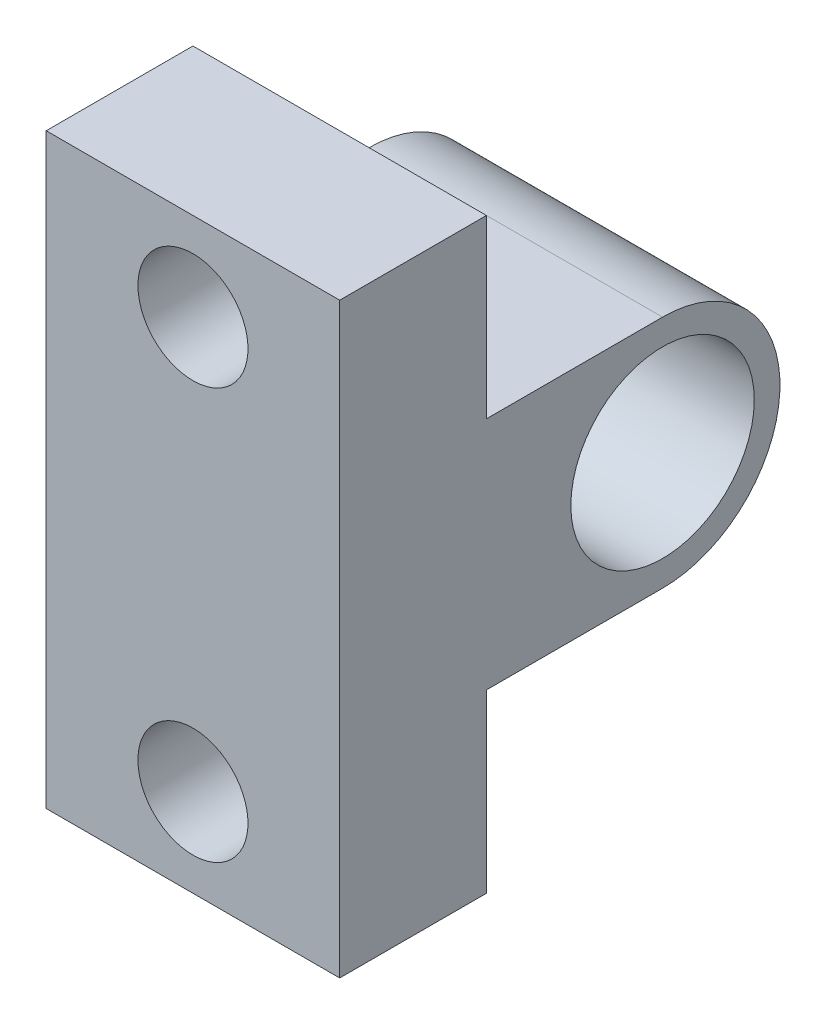
ISO-10303-21;
HEADER;
FILE_DESCRIPTION(('STEP AP214'),'2;1');
FILE_NAME('part.step','',(''),(''),'','','');
FILE_SCHEMA(('AUTOMOTIVE_DESIGN { 1 0 10303 214 1 1 1 1 }'));
ENDSEC;
DATA;
#1=APPLICATION_CONTEXT('core data for automotive mechanical design processes');
#2=APPLICATION_PROTOCOL_DEFINITION('international standard','automotive_design',2000,#1);
#3=PRODUCT_CONTEXT('',#1,'mechanical');
#4=PRODUCT('Part','Part','',(#3));
#5=PRODUCT_RELATED_PRODUCT_CATEGORY('part','',(#4));
#6=PRODUCT_DEFINITION_FORMATION('','',#4);
#7=PRODUCT_DEFINITION_CONTEXT('part definition',#1,'design');
#8=PRODUCT_DEFINITION('design','',#6,#7);
#9=PRODUCT_DEFINITION_SHAPE('','',#8);
#10=(LENGTH_UNIT() NAMED_UNIT(*) SI_UNIT(.MILLI.,.METRE.));
#11=(NAMED_UNIT(*) PLANE_ANGLE_UNIT() SI_UNIT($,.RADIAN.));
#12=(NAMED_UNIT(*) SI_UNIT($,.STERADIAN.) SOLID_ANGLE_UNIT());
#13=UNCERTAINTY_MEASURE_WITH_UNIT(LENGTH_MEASURE(1.E-05),#10,'distance_accuracy_value','');
#14=(GEOMETRIC_REPRESENTATION_CONTEXT(3) GLOBAL_UNCERTAINTY_ASSIGNED_CONTEXT((#13)) GLOBAL_UNIT_ASSIGNED_CONTEXT((#10,
#11,#12)) REPRESENTATION_CONTEXT('',''));
#15=CARTESIAN_POINT('',(0.,0.,0.));
#16=DIRECTION('',(0.,0.,1.));
#17=DIRECTION('',(1.,0.,0.));
#18=AXIS2_PLACEMENT_3D('',#15,#16,#17);
#19=CARTESIAN_POINT('',(12.7,10.074963407489,18.9671345265356));
#20=DIRECTION('',(1.,0.,0.));
#21=DIRECTION('',(0.,0.,-1.));
#22=AXIS2_PLACEMENT_3D('',#19,#20,#21);
#23=PLANE('',#22);
#24=CARTESIAN_POINT('',(12.7,10.074963407489,18.9671345265356));
#25=DIRECTION('',(1.,0.,0.));
#26=DIRECTION('',(0.,0.,-1.));
#27=AXIS2_PLACEMENT_3D('',#24,#25,#26);
#28=CIRCLE('',#27,5.08);
#29=CARTESIAN_POINT('',(12.7,4.99496340748897,18.9671345265356));
#30=VERTEX_POINT('',#29);
#31=CARTESIAN_POINT('',(12.7,15.154963407489,18.9671345265356));
#32=VERTEX_POINT('',#31);
#33=EDGE_CURVE('E151',#30,#32,#28,.T.);
#34=ORIENTED_EDGE('',*,*,#33,.T.);
#35=DIRECTION('',(0.,0.,1.));
#36=VECTOR('',#35,1.);
#37=CARTESIAN_POINT('',(12.7,15.154963407489,18.9671345265356));
#38=LINE('',#37,#36);
#39=CARTESIAN_POINT('',(12.7,15.154963407489,26.5871345265356));
#40=VERTEX_POINT('',#39);
#41=EDGE_CURVE('E99',#32,#40,#38,.T.);
#42=ORIENTED_EDGE('',*,*,#41,.T.);
#43=DIRECTION('',(0.,1.,0.));
#44=VECTOR('',#43,1.);
#45=CARTESIAN_POINT('',(12.7,22.774963407489,26.5871345265356));
#46=LINE('',#45,#44);
#47=CARTESIAN_POINT('',(12.7,22.774963407489,26.5871345265356));
#48=VERTEX_POINT('',#47);
#49=EDGE_CURVE('E166',#40,#48,#46,.T.);
#50=ORIENTED_EDGE('',*,*,#49,.T.);
#51=DIRECTION('',(0.,0.,1.));
#52=VECTOR('',#51,1.);
#53=CARTESIAN_POINT('',(12.7,22.774963407489,26.5871345265356));
#54=LINE('',#53,#52);
#55=CARTESIAN_POINT('',(12.7,22.774963407489,32.9371345265357));
#56=VERTEX_POINT('',#55);
#57=EDGE_CURVE('E179',#48,#56,#54,.T.);
#58=ORIENTED_EDGE('',*,*,#57,.T.);
#59=DIRECTION('',(0.,-1.,0.));
#60=VECTOR('',#59,1.);
#61=CARTESIAN_POINT('',(12.7,22.774963407489,32.9371345265357));
#62=LINE('',#61,#60);
#63=CARTESIAN_POINT('',(12.7,-2.62503659251103,32.9371345265357));
#64=VERTEX_POINT('',#63);
#65=EDGE_CURVE('E118',#56,#64,#62,.T.);
#66=ORIENTED_EDGE('',*,*,#65,.T.);
#67=DIRECTION('',(0.,0.,-1.));
#68=VECTOR('',#67,1.);
#69=CARTESIAN_POINT('',(12.7,-2.62503659251104,26.5871345265356));
#70=LINE('',#69,#68);
#71=CARTESIAN_POINT('',(12.7,-2.62503659251104,26.5871345265356));
#72=VERTEX_POINT('',#71);
#73=EDGE_CURVE('E112',#64,#72,#70,.T.);
#74=ORIENTED_EDGE('',*,*,#73,.T.);
#75=DIRECTION('',(0.,1.,0.));
#76=VECTOR('',#75,1.);
#77=CARTESIAN_POINT('',(12.7,4.99496340748897,26.5871345265356));
#78=LINE('',#77,#76);
#79=CARTESIAN_POINT('',(12.7,4.99496340748897,26.5871345265356));
#80=VERTEX_POINT('',#79);
#81=EDGE_CURVE('E116',#72,#80,#78,.T.);
#82=ORIENTED_EDGE('',*,*,#81,.T.);
#83=DIRECTION('',(0.,0.,-1.));
#84=VECTOR('',#83,1.);
#85=CARTESIAN_POINT('',(12.7,4.99496340748897,18.9671345265356));
#86=LINE('',#85,#84);
#87=EDGE_CURVE('E56',#80,#30,#86,.T.);
#88=ORIENTED_EDGE('',*,*,#87,.T.);
#89=EDGE_LOOP('',(#34,#42,#50,#58,#66,#74,#82,#88));
#90=FACE_BOUND('',#89,.T.);
#91=CARTESIAN_POINT('',(12.7,10.074963407489,18.9671345265356));
#92=DIRECTION('',(1.,0.,0.));
#93=DIRECTION('',(0.,0.,-1.));
#94=AXIS2_PLACEMENT_3D('',#91,#92,#93);
#95=CIRCLE('',#94,3.96875);
#96=CARTESIAN_POINT('',(12.7,10.074963407489,14.9983845265356));
#97=VERTEX_POINT('',#96);
#98=EDGE_CURVE('E140',#97,#97,#95,.T.);
#99=ORIENTED_EDGE('',*,*,#98,.F.);
#100=EDGE_LOOP('',(#99));
#101=FACE_BOUND('',#100,.T.);
#102=ADVANCED_FACE('F39',(#90,#101),#23,.T.);
#103=CARTESIAN_POINT('',(0.,10.074963407489,18.9671345265356));
#104=DIRECTION('',(1.,0.,0.));
#105=DIRECTION('',(0.,0.,-1.));
#106=AXIS2_PLACEMENT_3D('',#103,#104,#105);
#107=PLANE('',#106);
#108=CARTESIAN_POINT('',(0.,10.074963407489,18.9671345265356));
#109=DIRECTION('',(1.,0.,0.));
#110=DIRECTION('',(0.,0.,-1.));
#111=AXIS2_PLACEMENT_3D('',#108,#109,#110);
#112=CIRCLE('',#111,5.08);
#113=CARTESIAN_POINT('',(0.,4.99496340748897,18.9671345265356));
#114=VERTEX_POINT('',#113);
#115=CARTESIAN_POINT('',(0.,15.154963407489,18.9671345265356));
#116=VERTEX_POINT('',#115);
#117=EDGE_CURVE('E136',#114,#116,#112,.T.);
#118=ORIENTED_EDGE('',*,*,#117,.F.);
#119=DIRECTION('',(0.,0.,-1.));
#120=VECTOR('',#119,1.);
#121=CARTESIAN_POINT('',(0.,4.99496340748897,18.9671345265356));
#122=LINE('',#121,#120);
#123=CARTESIAN_POINT('',(0.,4.99496340748897,26.5871345265356));
#124=VERTEX_POINT('',#123);
#125=EDGE_CURVE('E91',#124,#114,#122,.T.);
#126=ORIENTED_EDGE('',*,*,#125,.F.);
#127=DIRECTION('',(0.,1.,0.));
#128=VECTOR('',#127,1.);
#129=CARTESIAN_POINT('',(0.,4.99496340748897,26.5871345265356));
#130=LINE('',#129,#128);
#131=CARTESIAN_POINT('',(0.,-2.62503659251104,26.5871345265356));
#132=VERTEX_POINT('',#131);
#133=EDGE_CURVE('E85',#132,#124,#130,.T.);
#134=ORIENTED_EDGE('',*,*,#133,.F.);
#135=DIRECTION('',(0.,0.,-1.));
#136=VECTOR('',#135,1.);
#137=CARTESIAN_POINT('',(0.,-2.62503659251104,26.5871345265356));
#138=LINE('',#137,#136);
#139=CARTESIAN_POINT('',(0.,-2.62503659251103,32.9371345265357));
#140=VERTEX_POINT('',#139);
#141=EDGE_CURVE('E126',#140,#132,#138,.T.);
#142=ORIENTED_EDGE('',*,*,#141,.F.);
#143=DIRECTION('',(0.,-1.,0.));
#144=VECTOR('',#143,1.);
#145=CARTESIAN_POINT('',(0.,22.774963407489,32.9371345265357));
#146=LINE('',#145,#144);
#147=CARTESIAN_POINT('',(0.,22.774963407489,32.9371345265357));
#148=VERTEX_POINT('',#147);
#149=EDGE_CURVE('E146',#148,#140,#146,.T.);
#150=ORIENTED_EDGE('',*,*,#149,.F.);
#151=DIRECTION('',(0.,0.,1.));
#152=VECTOR('',#151,1.);
#153=CARTESIAN_POINT('',(0.,22.774963407489,26.5871345265356));
#154=LINE('',#153,#152);
#155=CARTESIAN_POINT('',(0.,22.774963407489,26.5871345265356));
#156=VERTEX_POINT('',#155);
#157=EDGE_CURVE('E144',#156,#148,#154,.T.);
#158=ORIENTED_EDGE('',*,*,#157,.F.);
#159=DIRECTION('',(0.,1.,0.));
#160=VECTOR('',#159,1.);
#161=CARTESIAN_POINT('',(0.,22.774963407489,26.5871345265356));
#162=LINE('',#161,#160);
#163=CARTESIAN_POINT('',(0.,15.154963407489,26.5871345265356));
#164=VERTEX_POINT('',#163);
#165=EDGE_CURVE('E142',#164,#156,#162,.T.);
#166=ORIENTED_EDGE('',*,*,#165,.F.);
#167=DIRECTION('',(0.,0.,1.));
#168=VECTOR('',#167,1.);
#169=CARTESIAN_POINT('',(0.,15.154963407489,18.9671345265356));
#170=LINE('',#169,#168);
#171=EDGE_CURVE('E139',#116,#164,#170,.T.);
#172=ORIENTED_EDGE('',*,*,#171,.F.);
#173=EDGE_LOOP('',(#118,#126,#134,#142,#150,#158,#166,#172));
#174=FACE_BOUND('',#173,.T.);
#175=CARTESIAN_POINT('',(0.,10.074963407489,18.9671345265356));
#176=DIRECTION('',(1.,0.,0.));
#177=DIRECTION('',(0.,0.,-1.));
#178=AXIS2_PLACEMENT_3D('',#175,#176,#177);
#179=CIRCLE('',#178,3.96875);
#180=CARTESIAN_POINT('',(0.,10.074963407489,14.9983845265356));
#181=VERTEX_POINT('',#180);
#182=EDGE_CURVE('E185',#181,#181,#179,.T.);
#183=ORIENTED_EDGE('',*,*,#182,.T.);
#184=EDGE_LOOP('',(#183));
#185=FACE_BOUND('',#184,.T.);
#186=ADVANCED_FACE('F170',(#174,#185),#107,.F.);
#187=CARTESIAN_POINT('',(12.7,10.074963407489,18.9671345265356));
#188=DIRECTION('',(-1.,0.,0.));
#189=DIRECTION('',(0.,0.,1.));
#190=AXIS2_PLACEMENT_3D('',#187,#188,#189);
#191=CYLINDRICAL_SURFACE('',#190,5.08);
#192=ORIENTED_EDGE('',*,*,#117,.T.);
#193=DIRECTION('',(-1.,0.,0.));
#194=VECTOR('',#193,1.);
#195=CARTESIAN_POINT('',(12.7,15.154963407489,18.9671345265356));
#196=LINE('',#195,#194);
#197=EDGE_CURVE('E11',#32,#116,#196,.T.);
#198=ORIENTED_EDGE('',*,*,#197,.F.);
#199=ORIENTED_EDGE('',*,*,#33,.F.);
#200=DIRECTION('',(-1.,0.,0.));
#201=VECTOR('',#200,1.);
#202=CARTESIAN_POINT('',(12.7,4.99496340748897,18.9671345265356));
#203=LINE('',#202,#201);
#204=EDGE_CURVE('E132',#30,#114,#203,.T.);
#205=ORIENTED_EDGE('',*,*,#204,.T.);
#206=EDGE_LOOP('',(#192,#198,#199,#205));
#207=FACE_BOUND('',#206,.T.);
#208=ADVANCED_FACE('F41',(#207),#191,.T.);
#209=CARTESIAN_POINT('',(12.7,15.154963407489,18.9671345265356));
#210=DIRECTION('',(0.,-1.,0.));
#211=DIRECTION('',(0.,0.,-1.));
#212=AXIS2_PLACEMENT_3D('',#209,#210,#211);
#213=PLANE('',#212);
#214=ORIENTED_EDGE('',*,*,#171,.T.);
#215=DIRECTION('',(-1.,0.,0.));
#216=VECTOR('',#215,1.);
#217=CARTESIAN_POINT('',(12.7,15.154963407489,26.5871345265356));
#218=LINE('',#217,#216);
#219=EDGE_CURVE('E48',#40,#164,#218,.T.);
#220=ORIENTED_EDGE('',*,*,#219,.F.);
#221=ORIENTED_EDGE('',*,*,#41,.F.);
#222=ORIENTED_EDGE('',*,*,#197,.T.);
#223=EDGE_LOOP('',(#214,#220,#221,#222));
#224=FACE_BOUND('',#223,.T.);
#225=ADVANCED_FACE('F213',(#224),#213,.F.);
#226=CARTESIAN_POINT('',(12.7,22.774963407489,26.5871345265356));
#227=DIRECTION('',(0.,0.,1.));
#228=DIRECTION('',(0.,-1.,0.));
#229=AXIS2_PLACEMENT_3D('',#226,#227,#228);
#230=PLANE('',#229);
#231=CARTESIAN_POINT('',(6.35,18.964963407489,26.5871345265357));
#232=DIRECTION('',(0.,0.,-1.));
#233=DIRECTION('',(-1.,0.,0.));
#234=AXIS2_PLACEMENT_3D('',#231,#232,#233);
#235=CIRCLE('',#234,2.38125);
#236=CARTESIAN_POINT('',(3.96875,18.964963407489,26.5871345265357));
#237=VERTEX_POINT('',#236);
#238=EDGE_CURVE('E197',#237,#237,#235,.T.);
#239=ORIENTED_EDGE('',*,*,#238,.F.);
#240=EDGE_LOOP('',(#239));
#241=FACE_BOUND('',#240,.T.);
#242=ORIENTED_EDGE('',*,*,#165,.T.);
#243=DIRECTION('',(-1.,0.,0.));
#244=VECTOR('',#243,1.);
#245=CARTESIAN_POINT('',(12.7,22.774963407489,26.5871345265356));
#246=LINE('',#245,#244);
#247=EDGE_CURVE('E158',#48,#156,#246,.T.);
#248=ORIENTED_EDGE('',*,*,#247,.F.);
#249=ORIENTED_EDGE('',*,*,#49,.F.);
#250=ORIENTED_EDGE('',*,*,#219,.T.);
#251=EDGE_LOOP('',(#242,#248,#249,#250));
#252=FACE_BOUND('',#251,.T.);
#253=ADVANCED_FACE('F164',(#241,#252),#230,.F.);
#254=CARTESIAN_POINT('',(12.7,22.774963407489,26.5871345265356));
#255=DIRECTION('',(0.,-1.,0.));
#256=DIRECTION('',(0.,0.,-1.));
#257=AXIS2_PLACEMENT_3D('',#254,#255,#256);
#258=PLANE('',#257);
#259=ORIENTED_EDGE('',*,*,#157,.T.);
#260=DIRECTION('',(-1.,0.,0.));
#261=VECTOR('',#260,1.);
#262=CARTESIAN_POINT('',(12.7,22.774963407489,32.9371345265357));
#263=LINE('',#262,#261);
#264=EDGE_CURVE('E155',#56,#148,#263,.T.);
#265=ORIENTED_EDGE('',*,*,#264,.F.);
#266=ORIENTED_EDGE('',*,*,#57,.F.);
#267=ORIENTED_EDGE('',*,*,#247,.T.);
#268=EDGE_LOOP('',(#259,#265,#266,#267));
#269=FACE_BOUND('',#268,.T.);
#270=ADVANCED_FACE('F175',(#269),#258,.F.);
#271=CARTESIAN_POINT('',(12.7,22.774963407489,32.9371345265357));
#272=DIRECTION('',(0.,0.,-1.));
#273=DIRECTION('',(-1.,0.,0.));
#274=AXIS2_PLACEMENT_3D('',#271,#272,#273);
#275=PLANE('',#274);
#276=CARTESIAN_POINT('',(6.35,18.964963407489,32.9371345265357));
#277=DIRECTION('',(0.,0.,-1.));
#278=DIRECTION('',(-1.,0.,0.));
#279=AXIS2_PLACEMENT_3D('',#276,#277,#278);
#280=CIRCLE('',#279,2.38125);
#281=CARTESIAN_POINT('',(3.96875,18.964963407489,32.9371345265357));
#282=VERTEX_POINT('',#281);
#283=EDGE_CURVE('E188',#282,#282,#280,.T.);
#284=ORIENTED_EDGE('',*,*,#283,.T.);
#285=EDGE_LOOP('',(#284));
#286=FACE_BOUND('',#285,.T.);
#287=CARTESIAN_POINT('',(6.35,1.18496340748897,32.9371345265357));
#288=DIRECTION('',(0.,0.,-1.));
#289=DIRECTION('',(-1.,0.,0.));
#290=AXIS2_PLACEMENT_3D('',#287,#288,#289);
#291=CIRCLE('',#290,2.38125);
#292=CARTESIAN_POINT('',(3.96875,1.18496340748897,32.9371345265357));
#293=VERTEX_POINT('',#292);
#294=EDGE_CURVE('E191',#293,#293,#291,.T.);
#295=ORIENTED_EDGE('',*,*,#294,.T.);
#296=EDGE_LOOP('',(#295));
#297=FACE_BOUND('',#296,.T.);
#298=ORIENTED_EDGE('',*,*,#149,.T.);
#299=DIRECTION('',(-1.,0.,0.));
#300=VECTOR('',#299,1.);
#301=CARTESIAN_POINT('',(12.7,-2.62503659251103,32.9371345265357));
#302=LINE('',#301,#300);
#303=EDGE_CURVE('E127',#64,#140,#302,.T.);
#304=ORIENTED_EDGE('',*,*,#303,.F.);
#305=ORIENTED_EDGE('',*,*,#65,.F.);
#306=ORIENTED_EDGE('',*,*,#264,.T.);
#307=EDGE_LOOP('',(#298,#304,#305,#306));
#308=FACE_BOUND('',#307,.T.);
#309=ADVANCED_FACE('F178',(#286,#297,#308),#275,.F.);
#310=CARTESIAN_POINT('',(12.7,-2.62503659251104,26.5871345265356));
#311=DIRECTION('',(0.,1.,0.));
#312=DIRECTION('',(0.,0.,1.));
#313=AXIS2_PLACEMENT_3D('',#310,#311,#312);
#314=PLANE('',#313);
#315=ORIENTED_EDGE('',*,*,#141,.T.);
#316=DIRECTION('',(-1.,0.,0.));
#317=VECTOR('',#316,1.);
#318=CARTESIAN_POINT('',(12.7,-2.62503659251104,26.5871345265356));
#319=LINE('',#318,#317);
#320=EDGE_CURVE('E123',#72,#132,#319,.T.);
#321=ORIENTED_EDGE('',*,*,#320,.F.);
#322=ORIENTED_EDGE('',*,*,#73,.F.);
#323=ORIENTED_EDGE('',*,*,#303,.T.);
#324=EDGE_LOOP('',(#315,#321,#322,#323));
#325=FACE_BOUND('',#324,.T.);
#326=ADVANCED_FACE('F124',(#325),#314,.F.);
#327=CARTESIAN_POINT('',(12.7,4.99496340748897,26.5871345265356));
#328=DIRECTION('',(0.,0.,1.));
#329=DIRECTION('',(1.,0.,0.));
#330=AXIS2_PLACEMENT_3D('',#327,#328,#329);
#331=PLANE('',#330);
#332=CARTESIAN_POINT('',(6.35,1.18496340748897,26.5871345265357));
#333=DIRECTION('',(0.,0.,-1.));
#334=DIRECTION('',(-1.,0.,0.));
#335=AXIS2_PLACEMENT_3D('',#332,#333,#334);
#336=CIRCLE('',#335,2.38125);
#337=CARTESIAN_POINT('',(3.96875,1.18496340748897,26.5871345265357));
#338=VERTEX_POINT('',#337);
#339=EDGE_CURVE('E194',#338,#338,#336,.T.);
#340=ORIENTED_EDGE('',*,*,#339,.F.);
#341=EDGE_LOOP('',(#340));
#342=FACE_BOUND('',#341,.T.);
#343=ORIENTED_EDGE('',*,*,#133,.T.);
#344=DIRECTION('',(-1.,0.,0.));
#345=VECTOR('',#344,1.);
#346=CARTESIAN_POINT('',(12.7,4.99496340748897,26.5871345265356));
#347=LINE('',#346,#345);
#348=EDGE_CURVE('E128',#80,#124,#347,.T.);
#349=ORIENTED_EDGE('',*,*,#348,.F.);
#350=ORIENTED_EDGE('',*,*,#81,.F.);
#351=ORIENTED_EDGE('',*,*,#320,.T.);
#352=EDGE_LOOP('',(#343,#349,#350,#351));
#353=FACE_BOUND('',#352,.T.);
#354=ADVANCED_FACE('F130',(#342,#353),#331,.F.);
#355=CARTESIAN_POINT('',(12.7,4.99496340748897,18.9671345265356));
#356=DIRECTION('',(0.,1.,0.));
#357=DIRECTION('',(0.,0.,1.));
#358=AXIS2_PLACEMENT_3D('',#355,#356,#357);
#359=PLANE('',#358);
#360=ORIENTED_EDGE('',*,*,#125,.T.);
#361=ORIENTED_EDGE('',*,*,#204,.F.);
#362=ORIENTED_EDGE('',*,*,#87,.F.);
#363=ORIENTED_EDGE('',*,*,#348,.T.);
#364=EDGE_LOOP('',(#360,#361,#362,#363));
#365=FACE_BOUND('',#364,.T.);
#366=ADVANCED_FACE('F232',(#365),#359,.F.);
#367=CARTESIAN_POINT('',(12.7,10.074963407489,18.9671345265356));
#368=DIRECTION('',(-1.,0.,0.));
#369=DIRECTION('',(0.,0.,1.));
#370=AXIS2_PLACEMENT_3D('',#367,#368,#369);
#371=CYLINDRICAL_SURFACE('',#370,3.96875);
#372=ORIENTED_EDGE('',*,*,#98,.T.);
#373=EDGE_LOOP('',(#372));
#374=FACE_BOUND('',#373,.T.);
#375=ORIENTED_EDGE('',*,*,#182,.F.);
#376=EDGE_LOOP('',(#375));
#377=FACE_BOUND('',#376,.T.);
#378=ADVANCED_FACE('F229',(#374,#377),#371,.F.);
#379=CARTESIAN_POINT('',(6.35,1.18496340748897,32.9371345265357));
#380=DIRECTION('',(0.,0.,-1.));
#381=DIRECTION('',(-1.,0.,0.));
#382=AXIS2_PLACEMENT_3D('',#379,#380,#381);
#383=CYLINDRICAL_SURFACE('',#382,2.38125);
#384=ORIENTED_EDGE('',*,*,#294,.F.);
#385=EDGE_LOOP('',(#384));
#386=FACE_BOUND('',#385,.T.);
#387=ORIENTED_EDGE('',*,*,#339,.T.);
#388=EDGE_LOOP('',(#387));
#389=FACE_BOUND('',#388,.T.);
#390=ADVANCED_FACE('F208',(#386,#389),#383,.F.);
#391=CARTESIAN_POINT('',(6.35,18.964963407489,32.9371345265357));
#392=DIRECTION('',(0.,0.,-1.));
#393=DIRECTION('',(-1.,0.,0.));
#394=AXIS2_PLACEMENT_3D('',#391,#392,#393);
#395=CYLINDRICAL_SURFACE('',#394,2.38125);
#396=ORIENTED_EDGE('',*,*,#283,.F.);
#397=EDGE_LOOP('',(#396));
#398=FACE_BOUND('',#397,.T.);
#399=ORIENTED_EDGE('',*,*,#238,.T.);
#400=EDGE_LOOP('',(#399));
#401=FACE_BOUND('',#400,.T.);
#402=ADVANCED_FACE('F205',(#398,#401),#395,.F.);
#403=CLOSED_SHELL('',(#102,#186,#208,#225,#253,#270,#309,#326,#354,#366,#378,#390,#402));
#404=MANIFOLD_SOLID_BREP('B2',#403);
#405=ADVANCED_BREP_SHAPE_REPRESENTATION('',(#18,#404),#14);
#406=SHAPE_DEFINITION_REPRESENTATION(#9,#405);
ENDSEC;
END-ISO-10303-21;
